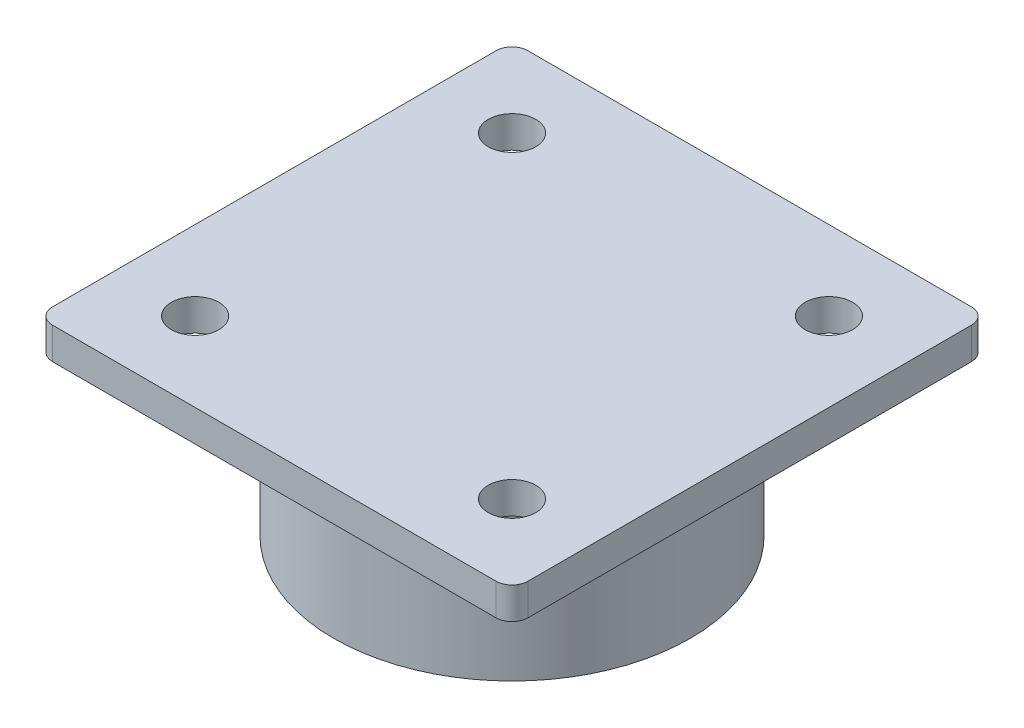
ISO-10303-21;
HEADER;
FILE_DESCRIPTION(('STEP AP214'),'2;1');
FILE_NAME('part.step','',(''),(''),'','','');
FILE_SCHEMA(('AUTOMOTIVE_DESIGN { 1 0 10303 214 1 1 1 1 }'));
ENDSEC;
DATA;
#1=APPLICATION_CONTEXT('core data for automotive mechanical design processes');
#2=APPLICATION_PROTOCOL_DEFINITION('international standard','automotive_design',2000,#1);
#3=PRODUCT_CONTEXT('',#1,'mechanical');
#4=PRODUCT('Part','Part','',(#3));
#5=PRODUCT_RELATED_PRODUCT_CATEGORY('part','',(#4));
#6=PRODUCT_DEFINITION_FORMATION('','',#4);
#7=PRODUCT_DEFINITION_CONTEXT('part definition',#1,'design');
#8=PRODUCT_DEFINITION('design','',#6,#7);
#9=PRODUCT_DEFINITION_SHAPE('','',#8);
#10=(LENGTH_UNIT() NAMED_UNIT(*) SI_UNIT(.MILLI.,.METRE.));
#11=(NAMED_UNIT(*) PLANE_ANGLE_UNIT() SI_UNIT($,.RADIAN.));
#12=(NAMED_UNIT(*) SI_UNIT($,.STERADIAN.) SOLID_ANGLE_UNIT());
#13=UNCERTAINTY_MEASURE_WITH_UNIT(LENGTH_MEASURE(1.E-05),#10,'distance_accuracy_value','');
#14=(GEOMETRIC_REPRESENTATION_CONTEXT(3) GLOBAL_UNCERTAINTY_ASSIGNED_CONTEXT((#13)) GLOBAL_UNIT_ASSIGNED_CONTEXT((#10,
#11,#12)) REPRESENTATION_CONTEXT('',''));
#15=CARTESIAN_POINT('',(0.,0.,0.));
#16=DIRECTION('',(0.,0.,1.));
#17=DIRECTION('',(1.,0.,0.));
#18=AXIS2_PLACEMENT_3D('',#15,#16,#17);
#19=CARTESIAN_POINT('',(35.56,5.08,35.56));
#20=DIRECTION('',(0.,1.,0.));
#21=DIRECTION('',(0.,0.,1.));
#22=AXIS2_PLACEMENT_3D('',#19,#20,#21);
#23=PLANE('',#22);
#24=CARTESIAN_POINT('',(25.4,5.08,25.4));
#25=DIRECTION('',(0.,1.,0.));
#26=DIRECTION('',(0.,0.,1.));
#27=AXIS2_PLACEMENT_3D('',#24,#25,#26);
#28=CIRCLE('',#27,3.81);
#29=CARTESIAN_POINT('',(25.4,5.08,29.21));
#30=VERTEX_POINT('',#29);
#31=EDGE_CURVE('E195',#30,#30,#28,.T.);
#32=ORIENTED_EDGE('',*,*,#31,.F.);
#33=EDGE_LOOP('',(#32));
#34=FACE_BOUND('',#33,.T.);
#35=CARTESIAN_POINT('',(-25.4,5.08,-25.4));
#36=DIRECTION('',(0.,1.,0.));
#37=DIRECTION('',(0.,0.,1.));
#38=AXIS2_PLACEMENT_3D('',#35,#36,#37);
#39=CIRCLE('',#38,3.81);
#40=CARTESIAN_POINT('',(-25.4,5.08,-21.59));
#41=VERTEX_POINT('',#40);
#42=EDGE_CURVE('E137',#41,#41,#39,.T.);
#43=ORIENTED_EDGE('',*,*,#42,.F.);
#44=EDGE_LOOP('',(#43));
#45=FACE_BOUND('',#44,.T.);
#46=CARTESIAN_POINT('',(35.56,5.08,35.56));
#47=DIRECTION('',(0.,1.,0.));
#48=DIRECTION('',(0.,0.,1.));
#49=AXIS2_PLACEMENT_3D('',#46,#47,#48);
#50=CIRCLE('',#49,2.54);
#51=CARTESIAN_POINT('',(35.56,5.08,38.1));
#52=VERTEX_POINT('',#51);
#53=CARTESIAN_POINT('',(38.1,5.08,35.56));
#54=VERTEX_POINT('',#53);
#55=EDGE_CURVE('E148',#52,#54,#50,.T.);
#56=ORIENTED_EDGE('',*,*,#55,.T.);
#57=DIRECTION('',(0.,0.,-1.));
#58=VECTOR('',#57,1.);
#59=CARTESIAN_POINT('',(38.1,5.08,-35.56));
#60=LINE('',#59,#58);
#61=CARTESIAN_POINT('',(38.1,5.08,-35.56));
#62=VERTEX_POINT('',#61);
#63=EDGE_CURVE('E96',#54,#62,#60,.T.);
#64=ORIENTED_EDGE('',*,*,#63,.T.);
#65=CARTESIAN_POINT('',(35.56,5.08,-35.56));
#66=DIRECTION('',(0.,1.,0.));
#67=DIRECTION('',(0.,0.,-1.));
#68=AXIS2_PLACEMENT_3D('',#65,#66,#67);
#69=CIRCLE('',#68,2.54);
#70=CARTESIAN_POINT('',(35.56,5.08,-38.1));
#71=VERTEX_POINT('',#70);
#72=EDGE_CURVE('E180',#62,#71,#69,.T.);
#73=ORIENTED_EDGE('',*,*,#72,.T.);
#74=DIRECTION('',(-1.,0.,0.));
#75=VECTOR('',#74,1.);
#76=CARTESIAN_POINT('',(-35.56,5.08,-38.1));
#77=LINE('',#76,#75);
#78=CARTESIAN_POINT('',(-35.56,5.08,-38.1));
#79=VERTEX_POINT('',#78);
#80=EDGE_CURVE('E179',#71,#79,#77,.T.);
#81=ORIENTED_EDGE('',*,*,#80,.T.);
#82=CARTESIAN_POINT('',(-35.56,5.08,-35.56));
#83=DIRECTION('',(0.,1.,0.));
#84=DIRECTION('',(0.,0.,1.));
#85=AXIS2_PLACEMENT_3D('',#82,#83,#84);
#86=CIRCLE('',#85,2.54);
#87=CARTESIAN_POINT('',(-38.1,5.08,-35.56));
#88=VERTEX_POINT('',#87);
#89=EDGE_CURVE('E115',#79,#88,#86,.T.);
#90=ORIENTED_EDGE('',*,*,#89,.T.);
#91=DIRECTION('',(0.,0.,1.));
#92=VECTOR('',#91,1.);
#93=CARTESIAN_POINT('',(-38.1,5.08,-35.56));
#94=LINE('',#93,#92);
#95=CARTESIAN_POINT('',(-38.1,5.08,35.56));
#96=VERTEX_POINT('',#95);
#97=EDGE_CURVE('E109',#88,#96,#94,.T.);
#98=ORIENTED_EDGE('',*,*,#97,.T.);
#99=CARTESIAN_POINT('',(-35.56,5.08,35.56));
#100=DIRECTION('',(0.,1.,0.));
#101=DIRECTION('',(0.,0.,1.));
#102=AXIS2_PLACEMENT_3D('',#99,#100,#101);
#103=CIRCLE('',#102,2.54);
#104=CARTESIAN_POINT('',(-35.56,5.08,38.1));
#105=VERTEX_POINT('',#104);
#106=EDGE_CURVE('E113',#96,#105,#103,.T.);
#107=ORIENTED_EDGE('',*,*,#106,.T.);
#108=DIRECTION('',(1.,0.,0.));
#109=VECTOR('',#108,1.);
#110=CARTESIAN_POINT('',(-35.56,5.08,38.1));
#111=LINE('',#110,#109);
#112=EDGE_CURVE('E52',#105,#52,#111,.T.);
#113=ORIENTED_EDGE('',*,*,#112,.T.);
#114=EDGE_LOOP('',(#56,#64,#73,#81,#90,#98,#107,#113));
#115=FACE_BOUND('',#114,.T.);
#116=CARTESIAN_POINT('',(25.4,5.08,-25.4));
#117=DIRECTION('',(0.,1.,0.));
#118=DIRECTION('',(0.,0.,1.));
#119=AXIS2_PLACEMENT_3D('',#116,#117,#118);
#120=CIRCLE('',#119,3.81);
#121=CARTESIAN_POINT('',(25.4,5.08,-21.59));
#122=VERTEX_POINT('',#121);
#123=EDGE_CURVE('E189',#122,#122,#120,.T.);
#124=ORIENTED_EDGE('',*,*,#123,.F.);
#125=EDGE_LOOP('',(#124));
#126=FACE_BOUND('',#125,.T.);
#127=CARTESIAN_POINT('',(-25.4,5.08,25.4));
#128=DIRECTION('',(0.,1.,0.));
#129=DIRECTION('',(0.,0.,1.));
#130=AXIS2_PLACEMENT_3D('',#127,#128,#129);
#131=CIRCLE('',#130,3.81);
#132=CARTESIAN_POINT('',(-25.4,5.08,29.21));
#133=VERTEX_POINT('',#132);
#134=EDGE_CURVE('E201',#133,#133,#131,.T.);
#135=ORIENTED_EDGE('',*,*,#134,.F.);
#136=EDGE_LOOP('',(#135));
#137=FACE_BOUND('',#136,.T.);
#138=ADVANCED_FACE('F35',(#34,#45,#115,#126,#137),#23,.T.);
#139=CARTESIAN_POINT('',(35.56,0.,35.56));
#140=DIRECTION('',(0.,1.,0.));
#141=DIRECTION('',(0.,0.,1.));
#142=AXIS2_PLACEMENT_3D('',#139,#140,#141);
#143=PLANE('',#142);
#144=CARTESIAN_POINT('',(0.,0.,0.));
#145=DIRECTION('',(0.,1.,0.));
#146=DIRECTION('',(0.,0.,1.));
#147=AXIS2_PLACEMENT_3D('',#144,#145,#146);
#148=CIRCLE('',#147,28.575);
#149=CARTESIAN_POINT('',(0.,0.,28.575));
#150=VERTEX_POINT('',#149);
#151=EDGE_CURVE('E11',#150,#150,#148,.F.);
#152=ORIENTED_EDGE('',*,*,#151,.F.);
#153=EDGE_LOOP('',(#152));
#154=FACE_BOUND('',#153,.T.);
#155=CARTESIAN_POINT('',(35.56,0.,35.56));
#156=DIRECTION('',(0.,1.,0.));
#157=DIRECTION('',(0.,0.,1.));
#158=AXIS2_PLACEMENT_3D('',#155,#156,#157);
#159=CIRCLE('',#158,2.54);
#160=CARTESIAN_POINT('',(35.56,0.,38.1));
#161=VERTEX_POINT('',#160);
#162=CARTESIAN_POINT('',(38.1,0.,35.56));
#163=VERTEX_POINT('',#162);
#164=EDGE_CURVE('E133',#161,#163,#159,.T.);
#165=ORIENTED_EDGE('',*,*,#164,.F.);
#166=DIRECTION('',(1.,0.,0.));
#167=VECTOR('',#166,1.);
#168=CARTESIAN_POINT('',(-35.56,0.,38.1));
#169=LINE('',#168,#167);
#170=CARTESIAN_POINT('',(-35.56,0.,38.1));
#171=VERTEX_POINT('',#170);
#172=EDGE_CURVE('E87',#171,#161,#169,.T.);
#173=ORIENTED_EDGE('',*,*,#172,.F.);
#174=CARTESIAN_POINT('',(-35.56,0.,35.56));
#175=DIRECTION('',(0.,1.,0.));
#176=DIRECTION('',(0.,0.,1.));
#177=AXIS2_PLACEMENT_3D('',#174,#175,#176);
#178=CIRCLE('',#177,2.54);
#179=CARTESIAN_POINT('',(-38.1,0.,35.56));
#180=VERTEX_POINT('',#179);
#181=EDGE_CURVE('E81',#180,#171,#178,.T.);
#182=ORIENTED_EDGE('',*,*,#181,.F.);
#183=DIRECTION('',(0.,0.,1.));
#184=VECTOR('',#183,1.);
#185=CARTESIAN_POINT('',(-38.1,0.,-35.56));
#186=LINE('',#185,#184);
#187=CARTESIAN_POINT('',(-38.1,0.,-35.56));
#188=VERTEX_POINT('',#187);
#189=EDGE_CURVE('E123',#188,#180,#186,.T.);
#190=ORIENTED_EDGE('',*,*,#189,.F.);
#191=CARTESIAN_POINT('',(-35.56,0.,-35.56));
#192=DIRECTION('',(0.,1.,0.));
#193=DIRECTION('',(0.,0.,1.));
#194=AXIS2_PLACEMENT_3D('',#191,#192,#193);
#195=CIRCLE('',#194,2.54);
#196=CARTESIAN_POINT('',(-35.56,0.,-38.1));
#197=VERTEX_POINT('',#196);
#198=EDGE_CURVE('E143',#197,#188,#195,.T.);
#199=ORIENTED_EDGE('',*,*,#198,.F.);
#200=DIRECTION('',(-1.,0.,0.));
#201=VECTOR('',#200,1.);
#202=CARTESIAN_POINT('',(-35.56,0.,-38.1));
#203=LINE('',#202,#201);
#204=CARTESIAN_POINT('',(35.56,0.,-38.1));
#205=VERTEX_POINT('',#204);
#206=EDGE_CURVE('E141',#205,#197,#203,.T.);
#207=ORIENTED_EDGE('',*,*,#206,.F.);
#208=CARTESIAN_POINT('',(35.56,0.,-35.56));
#209=DIRECTION('',(0.,1.,0.));
#210=DIRECTION('',(0.,0.,-1.));
#211=AXIS2_PLACEMENT_3D('',#208,#209,#210);
#212=CIRCLE('',#211,2.54);
#213=CARTESIAN_POINT('',(38.1,0.,-35.56));
#214=VERTEX_POINT('',#213);
#215=EDGE_CURVE('E139',#214,#205,#212,.T.);
#216=ORIENTED_EDGE('',*,*,#215,.F.);
#217=DIRECTION('',(0.,0.,-1.));
#218=VECTOR('',#217,1.);
#219=CARTESIAN_POINT('',(38.1,0.,-35.56));
#220=LINE('',#219,#218);
#221=EDGE_CURVE('E136',#163,#214,#220,.T.);
#222=ORIENTED_EDGE('',*,*,#221,.F.);
#223=EDGE_LOOP('',(#165,#173,#182,#190,#199,#207,#216,#222));
#224=FACE_BOUND('',#223,.T.);
#225=CARTESIAN_POINT('',(-25.4,0.,-25.4));
#226=DIRECTION('',(0.,1.,0.));
#227=DIRECTION('',(0.,0.,1.));
#228=AXIS2_PLACEMENT_3D('',#225,#226,#227);
#229=CIRCLE('',#228,3.81);
#230=CARTESIAN_POINT('',(-25.4,0.,-21.59));
#231=VERTEX_POINT('',#230);
#232=EDGE_CURVE('E186',#231,#231,#229,.T.);
#233=ORIENTED_EDGE('',*,*,#232,.T.);
#234=EDGE_LOOP('',(#233));
#235=FACE_BOUND('',#234,.T.);
#236=CARTESIAN_POINT('',(25.4,0.,-25.4));
#237=DIRECTION('',(0.,1.,0.));
#238=DIRECTION('',(0.,0.,1.));
#239=AXIS2_PLACEMENT_3D('',#236,#237,#238);
#240=CIRCLE('',#239,3.81);
#241=CARTESIAN_POINT('',(25.4,0.,-21.59));
#242=VERTEX_POINT('',#241);
#243=EDGE_CURVE('E192',#242,#242,#240,.T.);
#244=ORIENTED_EDGE('',*,*,#243,.T.);
#245=EDGE_LOOP('',(#244));
#246=FACE_BOUND('',#245,.T.);
#247=CARTESIAN_POINT('',(25.4,0.,25.4));
#248=DIRECTION('',(0.,1.,0.));
#249=DIRECTION('',(0.,0.,1.));
#250=AXIS2_PLACEMENT_3D('',#247,#248,#249);
#251=CIRCLE('',#250,3.81);
#252=CARTESIAN_POINT('',(25.4,0.,29.21));
#253=VERTEX_POINT('',#252);
#254=EDGE_CURVE('E198',#253,#253,#251,.T.);
#255=ORIENTED_EDGE('',*,*,#254,.T.);
#256=EDGE_LOOP('',(#255));
#257=FACE_BOUND('',#256,.T.);
#258=CARTESIAN_POINT('',(-25.4,0.,25.4));
#259=DIRECTION('',(0.,1.,0.));
#260=DIRECTION('',(0.,0.,1.));
#261=AXIS2_PLACEMENT_3D('',#258,#259,#260);
#262=CIRCLE('',#261,3.81);
#263=CARTESIAN_POINT('',(-25.4,0.,29.21));
#264=VERTEX_POINT('',#263);
#265=EDGE_CURVE('E204',#264,#264,#262,.T.);
#266=ORIENTED_EDGE('',*,*,#265,.T.);
#267=EDGE_LOOP('',(#266));
#268=FACE_BOUND('',#267,.T.);
#269=ADVANCED_FACE('F166',(#154,#224,#235,#246,#257,#268),#143,.F.);
#270=CARTESIAN_POINT('',(35.56,5.08,35.56));
#271=DIRECTION('',(0.,-1.,0.));
#272=DIRECTION('',(0.,0.,-1.));
#273=AXIS2_PLACEMENT_3D('',#270,#271,#272);
#274=CYLINDRICAL_SURFACE('',#273,2.54);
#275=ORIENTED_EDGE('',*,*,#164,.T.);
#276=DIRECTION('',(0.,-1.,0.));
#277=VECTOR('',#276,1.);
#278=CARTESIAN_POINT('',(38.1,5.08,35.56));
#279=LINE('',#278,#277);
#280=EDGE_CURVE('E44',#54,#163,#279,.T.);
#281=ORIENTED_EDGE('',*,*,#280,.F.);
#282=ORIENTED_EDGE('',*,*,#55,.F.);
#283=DIRECTION('',(0.,-1.,0.));
#284=VECTOR('',#283,1.);
#285=CARTESIAN_POINT('',(35.56,5.08,38.1));
#286=LINE('',#285,#284);
#287=EDGE_CURVE('E129',#52,#161,#286,.T.);
#288=ORIENTED_EDGE('',*,*,#287,.T.);
#289=EDGE_LOOP('',(#275,#281,#282,#288));
#290=FACE_BOUND('',#289,.T.);
#291=ADVANCED_FACE('F37',(#290),#274,.T.);
#292=CARTESIAN_POINT('',(38.1,5.08,-35.56));
#293=DIRECTION('',(-1.,0.,0.));
#294=DIRECTION('',(0.,0.,1.));
#295=AXIS2_PLACEMENT_3D('',#292,#293,#294);
#296=PLANE('',#295);
#297=ORIENTED_EDGE('',*,*,#221,.T.);
#298=DIRECTION('',(0.,-1.,0.));
#299=VECTOR('',#298,1.);
#300=CARTESIAN_POINT('',(38.1,5.08,-35.56));
#301=LINE('',#300,#299);
#302=EDGE_CURVE('E158',#62,#214,#301,.T.);
#303=ORIENTED_EDGE('',*,*,#302,.F.);
#304=ORIENTED_EDGE('',*,*,#63,.F.);
#305=ORIENTED_EDGE('',*,*,#280,.T.);
#306=EDGE_LOOP('',(#297,#303,#304,#305));
#307=FACE_BOUND('',#306,.T.);
#308=ADVANCED_FACE('F161',(#307),#296,.F.);
#309=CARTESIAN_POINT('',(35.56,5.08,-35.56));
#310=DIRECTION('',(0.,-1.,0.));
#311=DIRECTION('',(0.,0.,-1.));
#312=AXIS2_PLACEMENT_3D('',#309,#310,#311);
#313=CYLINDRICAL_SURFACE('',#312,2.54);
#314=ORIENTED_EDGE('',*,*,#215,.T.);
#315=DIRECTION('',(0.,-1.,0.));
#316=VECTOR('',#315,1.);
#317=CARTESIAN_POINT('',(35.56,5.08,-38.1));
#318=LINE('',#317,#316);
#319=EDGE_CURVE('E155',#71,#205,#318,.T.);
#320=ORIENTED_EDGE('',*,*,#319,.F.);
#321=ORIENTED_EDGE('',*,*,#72,.F.);
#322=ORIENTED_EDGE('',*,*,#302,.T.);
#323=EDGE_LOOP('',(#314,#320,#321,#322));
#324=FACE_BOUND('',#323,.T.);
#325=ADVANCED_FACE('F173',(#324),#313,.T.);
#326=CARTESIAN_POINT('',(-35.56,5.08,-38.1));
#327=DIRECTION('',(0.,0.,1.));
#328=DIRECTION('',(1.,0.,0.));
#329=AXIS2_PLACEMENT_3D('',#326,#327,#328);
#330=PLANE('',#329);
#331=ORIENTED_EDGE('',*,*,#206,.T.);
#332=DIRECTION('',(0.,-1.,0.));
#333=VECTOR('',#332,1.);
#334=CARTESIAN_POINT('',(-35.56,5.08,-38.1));
#335=LINE('',#334,#333);
#336=EDGE_CURVE('E152',#79,#197,#335,.T.);
#337=ORIENTED_EDGE('',*,*,#336,.F.);
#338=ORIENTED_EDGE('',*,*,#80,.F.);
#339=ORIENTED_EDGE('',*,*,#319,.T.);
#340=EDGE_LOOP('',(#331,#337,#338,#339));
#341=FACE_BOUND('',#340,.T.);
#342=ADVANCED_FACE('F177',(#341),#330,.F.);
#343=CARTESIAN_POINT('',(-35.56,5.08,-35.56));
#344=DIRECTION('',(0.,-1.,0.));
#345=DIRECTION('',(0.,0.,-1.));
#346=AXIS2_PLACEMENT_3D('',#343,#344,#345);
#347=CYLINDRICAL_SURFACE('',#346,2.54);
#348=ORIENTED_EDGE('',*,*,#198,.T.);
#349=DIRECTION('',(0.,-1.,0.));
#350=VECTOR('',#349,1.);
#351=CARTESIAN_POINT('',(-38.1,5.08,-35.56));
#352=LINE('',#351,#350);
#353=EDGE_CURVE('E124',#88,#188,#352,.T.);
#354=ORIENTED_EDGE('',*,*,#353,.F.);
#355=ORIENTED_EDGE('',*,*,#89,.F.);
#356=ORIENTED_EDGE('',*,*,#336,.T.);
#357=EDGE_LOOP('',(#348,#354,#355,#356));
#358=FACE_BOUND('',#357,.T.);
#359=ADVANCED_FACE('F258',(#358),#347,.T.);
#360=CARTESIAN_POINT('',(-38.1,5.08,-35.56));
#361=DIRECTION('',(1.,0.,0.));
#362=DIRECTION('',(0.,0.,-1.));
#363=AXIS2_PLACEMENT_3D('',#360,#361,#362);
#364=PLANE('',#363);
#365=ORIENTED_EDGE('',*,*,#189,.T.);
#366=DIRECTION('',(0.,-1.,0.));
#367=VECTOR('',#366,1.);
#368=CARTESIAN_POINT('',(-38.1,5.08,35.56));
#369=LINE('',#368,#367);
#370=EDGE_CURVE('E120',#96,#180,#369,.T.);
#371=ORIENTED_EDGE('',*,*,#370,.F.);
#372=ORIENTED_EDGE('',*,*,#97,.F.);
#373=ORIENTED_EDGE('',*,*,#353,.T.);
#374=EDGE_LOOP('',(#365,#371,#372,#373));
#375=FACE_BOUND('',#374,.T.);
#376=ADVANCED_FACE('F121',(#375),#364,.F.);
#377=CARTESIAN_POINT('',(-35.56,5.08,35.56));
#378=DIRECTION('',(0.,-1.,0.));
#379=DIRECTION('',(0.,0.,-1.));
#380=AXIS2_PLACEMENT_3D('',#377,#378,#379);
#381=CYLINDRICAL_SURFACE('',#380,2.54);
#382=ORIENTED_EDGE('',*,*,#181,.T.);
#383=DIRECTION('',(0.,-1.,0.));
#384=VECTOR('',#383,1.);
#385=CARTESIAN_POINT('',(-35.56,5.08,38.1));
#386=LINE('',#385,#384);
#387=EDGE_CURVE('E125',#105,#171,#386,.T.);
#388=ORIENTED_EDGE('',*,*,#387,.F.);
#389=ORIENTED_EDGE('',*,*,#106,.F.);
#390=ORIENTED_EDGE('',*,*,#370,.T.);
#391=EDGE_LOOP('',(#382,#388,#389,#390));
#392=FACE_BOUND('',#391,.T.);
#393=ADVANCED_FACE('F127',(#392),#381,.T.);
#394=CARTESIAN_POINT('',(-35.56,5.08,38.1));
#395=DIRECTION('',(0.,0.,-1.));
#396=DIRECTION('',(-1.,0.,0.));
#397=AXIS2_PLACEMENT_3D('',#394,#395,#396);
#398=PLANE('',#397);
#399=ORIENTED_EDGE('',*,*,#172,.T.);
#400=ORIENTED_EDGE('',*,*,#287,.F.);
#401=ORIENTED_EDGE('',*,*,#112,.F.);
#402=ORIENTED_EDGE('',*,*,#387,.T.);
#403=EDGE_LOOP('',(#399,#400,#401,#402));
#404=FACE_BOUND('',#403,.T.);
#405=ADVANCED_FACE('F250',(#404),#398,.F.);
#406=CARTESIAN_POINT('',(-25.4,5.08,-25.4));
#407=DIRECTION('',(0.,-1.,0.));
#408=DIRECTION('',(0.,0.,-1.));
#409=AXIS2_PLACEMENT_3D('',#406,#407,#408);
#410=CYLINDRICAL_SURFACE('',#409,3.81);
#411=ORIENTED_EDGE('',*,*,#42,.T.);
#412=EDGE_LOOP('',(#411));
#413=FACE_BOUND('',#412,.T.);
#414=ORIENTED_EDGE('',*,*,#232,.F.);
#415=EDGE_LOOP('',(#414));
#416=FACE_BOUND('',#415,.T.);
#417=ADVANCED_FACE('F253',(#413,#416),#410,.F.);
#418=CARTESIAN_POINT('',(25.4,5.08,-25.4));
#419=DIRECTION('',(0.,-1.,0.));
#420=DIRECTION('',(0.,0.,-1.));
#421=AXIS2_PLACEMENT_3D('',#418,#419,#420);
#422=CYLINDRICAL_SURFACE('',#421,3.81);
#423=ORIENTED_EDGE('',*,*,#123,.T.);
#424=EDGE_LOOP('',(#423));
#425=FACE_BOUND('',#424,.T.);
#426=ORIENTED_EDGE('',*,*,#243,.F.);
#427=EDGE_LOOP('',(#426));
#428=FACE_BOUND('',#427,.T.);
#429=ADVANCED_FACE('F300',(#425,#428),#422,.F.);
#430=CARTESIAN_POINT('',(25.4,5.08,25.4));
#431=DIRECTION('',(0.,-1.,0.));
#432=DIRECTION('',(0.,0.,-1.));
#433=AXIS2_PLACEMENT_3D('',#430,#431,#432);
#434=CYLINDRICAL_SURFACE('',#433,3.81);
#435=ORIENTED_EDGE('',*,*,#31,.T.);
#436=EDGE_LOOP('',(#435));
#437=FACE_BOUND('',#436,.T.);
#438=ORIENTED_EDGE('',*,*,#254,.F.);
#439=EDGE_LOOP('',(#438));
#440=FACE_BOUND('',#439,.T.);
#441=ADVANCED_FACE('F307',(#437,#440),#434,.F.);
#442=CARTESIAN_POINT('',(-25.4,5.08,25.4));
#443=DIRECTION('',(0.,-1.,0.));
#444=DIRECTION('',(0.,0.,-1.));
#445=AXIS2_PLACEMENT_3D('',#442,#443,#444);
#446=CYLINDRICAL_SURFACE('',#445,3.81);
#447=ORIENTED_EDGE('',*,*,#134,.T.);
#448=EDGE_LOOP('',(#447));
#449=FACE_BOUND('',#448,.T.);
#450=ORIENTED_EDGE('',*,*,#265,.F.);
#451=EDGE_LOOP('',(#450));
#452=FACE_BOUND('',#451,.T.);
#453=ADVANCED_FACE('F236',(#449,#452),#446,.F.);
#454=CARTESIAN_POINT('',(0.,-25.4,0.));
#455=DIRECTION('',(0.,1.,0.));
#456=DIRECTION('',(0.,0.,1.));
#457=AXIS2_PLACEMENT_3D('',#454,#455,#456);
#458=CYLINDRICAL_SURFACE('',#457,28.575);
#459=CARTESIAN_POINT('',(0.,-25.4,0.));
#460=DIRECTION('',(0.,-1.,0.));
#461=DIRECTION('',(0.,0.,-1.));
#462=AXIS2_PLACEMENT_3D('',#459,#460,#461);
#463=CIRCLE('',#462,28.575);
#464=CARTESIAN_POINT('',(0.,-25.4,-28.575));
#465=VERTEX_POINT('',#464);
#466=EDGE_CURVE('E207',#465,#465,#463,.T.);
#467=ORIENTED_EDGE('',*,*,#466,.F.);
#468=EDGE_LOOP('',(#467));
#469=FACE_BOUND('',#468,.T.);
#470=ORIENTED_EDGE('',*,*,#151,.T.);
#471=EDGE_LOOP('',(#470));
#472=FACE_BOUND('',#471,.T.);
#473=ADVANCED_FACE('F230',(#469,#472),#458,.T.);
#474=CARTESIAN_POINT('',(0.,-25.4,0.));
#475=DIRECTION('',(0.,-1.,0.));
#476=DIRECTION('',(0.,0.,-1.));
#477=AXIS2_PLACEMENT_3D('',#474,#475,#476);
#478=PLANE('',#477);
#479=CARTESIAN_POINT('',(0.,-25.4,0.));
#480=DIRECTION('',(0.,-1.,0.));
#481=DIRECTION('',(0.,0.,-1.));
#482=AXIS2_PLACEMENT_3D('',#479,#480,#481);
#483=CIRCLE('',#482,24.2824);
#484=CARTESIAN_POINT('',(0.,-25.4,-24.2824));
#485=VERTEX_POINT('',#484);
#486=EDGE_CURVE('E213',#485,#485,#483,.T.);
#487=ORIENTED_EDGE('',*,*,#486,.F.);
#488=EDGE_LOOP('',(#487));
#489=FACE_BOUND('',#488,.T.);
#490=ORIENTED_EDGE('',*,*,#466,.T.);
#491=EDGE_LOOP('',(#490));
#492=FACE_BOUND('',#491,.T.);
#493=ADVANCED_FACE('F224',(#489,#492),#478,.T.);
#494=CARTESIAN_POINT('',(0.,-6.35,0.));
#495=DIRECTION('',(0.,-1.,0.));
#496=DIRECTION('',(0.,0.,-1.));
#497=AXIS2_PLACEMENT_3D('',#494,#495,#496);
#498=CYLINDRICAL_SURFACE('',#497,24.2824);
#499=CARTESIAN_POINT('',(0.,-6.35,0.));
#500=DIRECTION('',(0.,-1.,0.));
#501=DIRECTION('',(0.,0.,-1.));
#502=AXIS2_PLACEMENT_3D('',#499,#500,#501);
#503=CIRCLE('',#502,24.2824);
#504=CARTESIAN_POINT('',(0.,-6.35,-24.2824));
#505=VERTEX_POINT('',#504);
#506=EDGE_CURVE('E212',#505,#505,#503,.T.);
#507=ORIENTED_EDGE('',*,*,#506,.F.);
#508=EDGE_LOOP('',(#507));
#509=FACE_BOUND('',#508,.T.);
#510=ORIENTED_EDGE('',*,*,#486,.T.);
#511=EDGE_LOOP('',(#510));
#512=FACE_BOUND('',#511,.T.);
#513=ADVANCED_FACE('F221',(#509,#512),#498,.F.);
#514=CARTESIAN_POINT('',(0.,-6.35,0.));
#515=DIRECTION('',(0.,-1.,0.));
#516=DIRECTION('',(0.,0.,-1.));
#517=AXIS2_PLACEMENT_3D('',#514,#515,#516);
#518=PLANE('',#517);
#519=ORIENTED_EDGE('',*,*,#506,.T.);
#520=EDGE_LOOP('',(#519));
#521=FACE_BOUND('',#520,.T.);
#522=ADVANCED_FACE('F219',(#521),#518,.T.);
#523=CLOSED_SHELL('',(#138,#269,#291,#308,#325,#342,#359,#376,#393,#405,#417,#429,#441,#453,
#473,#493,#513,#522));
#524=MANIFOLD_SOLID_BREP('B2',#523);
#525=ADVANCED_BREP_SHAPE_REPRESENTATION('',(#18,#524),#14);
#526=SHAPE_DEFINITION_REPRESENTATION(#9,#525);
ENDSEC;
END-ISO-10303-21;
